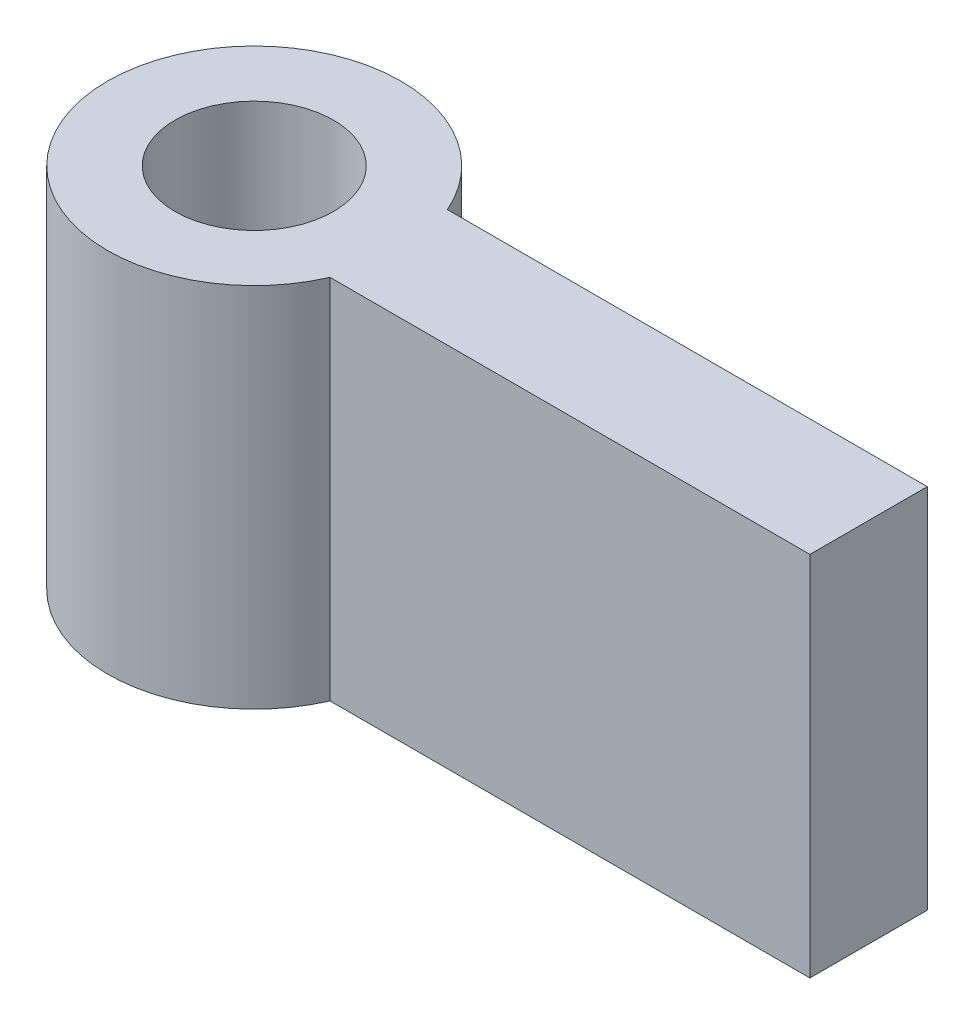
ISO-10303-21;
HEADER;
FILE_DESCRIPTION(('STEP AP214'),'2;1');
FILE_NAME('part.step','',(''),(''),'','','');
FILE_SCHEMA(('AUTOMOTIVE_DESIGN { 1 0 10303 214 1 1 1 1 }'));
ENDSEC;
DATA;
#1=APPLICATION_CONTEXT('core data for automotive mechanical design processes');
#2=APPLICATION_PROTOCOL_DEFINITION('international standard','automotive_design',2000,#1);
#3=PRODUCT_CONTEXT('',#1,'mechanical');
#4=PRODUCT('Part','Part','',(#3));
#5=PRODUCT_RELATED_PRODUCT_CATEGORY('part','',(#4));
#6=PRODUCT_DEFINITION_FORMATION('','',#4);
#7=PRODUCT_DEFINITION_CONTEXT('part definition',#1,'design');
#8=PRODUCT_DEFINITION('design','',#6,#7);
#9=PRODUCT_DEFINITION_SHAPE('','',#8);
#10=(LENGTH_UNIT() NAMED_UNIT(*) SI_UNIT(.MILLI.,.METRE.));
#11=(NAMED_UNIT(*) PLANE_ANGLE_UNIT() SI_UNIT($,.RADIAN.));
#12=(NAMED_UNIT(*) SI_UNIT($,.STERADIAN.) SOLID_ANGLE_UNIT());
#13=UNCERTAINTY_MEASURE_WITH_UNIT(LENGTH_MEASURE(1.E-05),#10,'distance_accuracy_value','');
#14=(GEOMETRIC_REPRESENTATION_CONTEXT(3) GLOBAL_UNCERTAINTY_ASSIGNED_CONTEXT((#13)) GLOBAL_UNIT_ASSIGNED_CONTEXT((#10,
#11,#12)) REPRESENTATION_CONTEXT('',''));
#15=CARTESIAN_POINT('',(0.,0.,0.));
#16=DIRECTION('',(0.,0.,1.));
#17=DIRECTION('',(1.,0.,0.));
#18=AXIS2_PLACEMENT_3D('',#15,#16,#17);
#19=CARTESIAN_POINT('',(-5.81985810583744,15.875,-2.54002984784004));
#20=DIRECTION('',(0.,-1.,0.));
#21=DIRECTION('',(0.,0.,-1.));
#22=AXIS2_PLACEMENT_3D('',#19,#20,#21);
#23=CYLINDRICAL_SURFACE('',#22,6.35);
#24=CARTESIAN_POINT('',(-5.81985810583744,0.,-2.54002984784004));
#25=DIRECTION('',(0.,1.,0.));
#26=DIRECTION('',(0.,0.,-1.));
#27=AXIS2_PLACEMENT_3D('',#24,#25,#26);
#28=CIRCLE('',#27,6.35);
#29=CARTESIAN_POINT('',(2.6053330726963E-05,0.,-5.08));
#30=VERTEX_POINT('',#29);
#31=CARTESIAN_POINT('',(0.,0.,0.));
#32=VERTEX_POINT('',#31);
#33=EDGE_CURVE('E98',#30,#32,#28,.T.);
#34=ORIENTED_EDGE('',*,*,#33,.T.);
#35=DIRECTION('',(0.,-1.,0.));
#36=VECTOR('',#35,1.);
#37=CARTESIAN_POINT('',(0.,15.875,0.));
#38=LINE('',#37,#36);
#39=CARTESIAN_POINT('',(0.,15.875,0.));
#40=VERTEX_POINT('',#39);
#41=EDGE_CURVE('E11',#40,#32,#38,.T.);
#42=ORIENTED_EDGE('',*,*,#41,.F.);
#43=CARTESIAN_POINT('',(-5.81985810583744,15.875,-2.54002984784004));
#44=DIRECTION('',(0.,1.,0.));
#45=DIRECTION('',(0.,0.,-1.));
#46=AXIS2_PLACEMENT_3D('',#43,#44,#45);
#47=CIRCLE('',#46,6.35);
#48=CARTESIAN_POINT('',(2.6053330726963E-05,15.875,-5.08));
#49=VERTEX_POINT('',#48);
#50=EDGE_CURVE('E85',#49,#40,#47,.T.);
#51=ORIENTED_EDGE('',*,*,#50,.F.);
#52=DIRECTION('',(0.,-1.,0.));
#53=VECTOR('',#52,1.);
#54=CARTESIAN_POINT('',(2.6053330726963E-05,15.875,-5.08));
#55=LINE('',#54,#53);
#56=EDGE_CURVE('E94',#49,#30,#55,.T.);
#57=ORIENTED_EDGE('',*,*,#56,.T.);
#58=EDGE_LOOP('',(#34,#42,#51,#57));
#59=FACE_BOUND('',#58,.T.);
#60=ADVANCED_FACE('F33',(#59),#23,.T.);
#61=CARTESIAN_POINT('',(0.,15.875,0.));
#62=DIRECTION('',(0.,0.,-1.));
#63=DIRECTION('',(-1.,0.,0.));
#64=AXIS2_PLACEMENT_3D('',#61,#62,#63);
#65=PLANE('',#64);
#66=DIRECTION('',(1.,0.,0.));
#67=VECTOR('',#66,1.);
#68=CARTESIAN_POINT('',(0.,0.,0.));
#69=LINE('',#68,#67);
#70=CARTESIAN_POINT('',(20.7657960533307,0.,0.));
#71=VERTEX_POINT('',#70);
#72=EDGE_CURVE('E89',#32,#71,#69,.T.);
#73=ORIENTED_EDGE('',*,*,#72,.T.);
#74=DIRECTION('',(0.,-1.,0.));
#75=VECTOR('',#74,1.);
#76=CARTESIAN_POINT('',(20.7657960533307,15.875,0.));
#77=LINE('',#76,#75);
#78=CARTESIAN_POINT('',(20.7657960533307,15.875,0.));
#79=VERTEX_POINT('',#78);
#80=EDGE_CURVE('E42',#79,#71,#77,.T.);
#81=ORIENTED_EDGE('',*,*,#80,.F.);
#82=DIRECTION('',(1.,0.,0.));
#83=VECTOR('',#82,1.);
#84=CARTESIAN_POINT('',(0.,15.875,0.));
#85=LINE('',#84,#83);
#86=EDGE_CURVE('E80',#40,#79,#85,.T.);
#87=ORIENTED_EDGE('',*,*,#86,.F.);
#88=ORIENTED_EDGE('',*,*,#41,.T.);
#89=EDGE_LOOP('',(#73,#81,#87,#88));
#90=FACE_BOUND('',#89,.T.);
#91=ADVANCED_FACE('F88',(#90),#65,.F.);
#92=CARTESIAN_POINT('',(20.7657960533307,15.875,0.));
#93=DIRECTION('',(-1.,0.,0.));
#94=DIRECTION('',(0.,0.,1.));
#95=AXIS2_PLACEMENT_3D('',#92,#93,#94);
#96=PLANE('',#95);
#97=DIRECTION('',(0.,0.,-1.));
#98=VECTOR('',#97,1.);
#99=CARTESIAN_POINT('',(20.7657960533307,0.,0.));
#100=LINE('',#99,#98);
#101=CARTESIAN_POINT('',(20.7657960533307,0.,-5.08));
#102=VERTEX_POINT('',#101);
#103=EDGE_CURVE('E67',#71,#102,#100,.T.);
#104=ORIENTED_EDGE('',*,*,#103,.T.);
#105=DIRECTION('',(0.,-1.,0.));
#106=VECTOR('',#105,1.);
#107=CARTESIAN_POINT('',(20.7657960533307,15.875,-5.08));
#108=LINE('',#107,#106);
#109=CARTESIAN_POINT('',(20.7657960533307,15.875,-5.08));
#110=VERTEX_POINT('',#109);
#111=EDGE_CURVE('E90',#110,#102,#108,.T.);
#112=ORIENTED_EDGE('',*,*,#111,.F.);
#113=DIRECTION('',(0.,0.,-1.));
#114=VECTOR('',#113,1.);
#115=CARTESIAN_POINT('',(20.7657960533307,15.875,0.));
#116=LINE('',#115,#114);
#117=EDGE_CURVE('E83',#79,#110,#116,.T.);
#118=ORIENTED_EDGE('',*,*,#117,.F.);
#119=ORIENTED_EDGE('',*,*,#80,.T.);
#120=EDGE_LOOP('',(#104,#112,#118,#119));
#121=FACE_BOUND('',#120,.T.);
#122=ADVANCED_FACE('F92',(#121),#96,.F.);
#123=CARTESIAN_POINT('',(20.7657960533307,15.875,-5.08));
#124=DIRECTION('',(0.,0.,1.));
#125=DIRECTION('',(1.,0.,0.));
#126=AXIS2_PLACEMENT_3D('',#123,#124,#125);
#127=PLANE('',#126);
#128=DIRECTION('',(-1.,0.,0.));
#129=VECTOR('',#128,1.);
#130=CARTESIAN_POINT('',(20.7657960533307,0.,-5.08));
#131=LINE('',#130,#129);
#132=EDGE_CURVE('E73',#102,#30,#131,.T.);
#133=ORIENTED_EDGE('',*,*,#132,.T.);
#134=ORIENTED_EDGE('',*,*,#56,.F.);
#135=DIRECTION('',(-1.,0.,0.));
#136=VECTOR('',#135,1.);
#137=CARTESIAN_POINT('',(20.7657960533307,15.875,-5.08));
#138=LINE('',#137,#136);
#139=EDGE_CURVE('E50',#110,#49,#138,.T.);
#140=ORIENTED_EDGE('',*,*,#139,.F.);
#141=ORIENTED_EDGE('',*,*,#111,.T.);
#142=EDGE_LOOP('',(#133,#134,#140,#141));
#143=FACE_BOUND('',#142,.T.);
#144=ADVANCED_FACE('F105',(#143),#127,.F.);
#145=CARTESIAN_POINT('',(-5.81985810583744,15.875,-2.54002984784004));
#146=DIRECTION('',(0.,-1.,0.));
#147=DIRECTION('',(0.,0.,-1.));
#148=AXIS2_PLACEMENT_3D('',#145,#146,#147);
#149=PLANE('',#148);
#150=CARTESIAN_POINT('',(-5.81985810583744,15.875,-2.54002984784004));
#151=DIRECTION('',(0.,1.,0.));
#152=DIRECTION('',(0.,0.,1.));
#153=AXIS2_PLACEMENT_3D('',#150,#151,#152);
#154=CIRCLE('',#153,3.429);
#155=CARTESIAN_POINT('',(-5.81985810583744,15.875,0.888970152159963));
#156=VERTEX_POINT('',#155);
#157=EDGE_CURVE('E111',#156,#156,#154,.T.);
#158=ORIENTED_EDGE('',*,*,#157,.F.);
#159=EDGE_LOOP('',(#158));
#160=FACE_BOUND('',#159,.T.);
#161=ORIENTED_EDGE('',*,*,#50,.T.);
#162=ORIENTED_EDGE('',*,*,#86,.T.);
#163=ORIENTED_EDGE('',*,*,#117,.T.);
#164=ORIENTED_EDGE('',*,*,#139,.T.);
#165=EDGE_LOOP('',(#161,#162,#163,#164));
#166=FACE_BOUND('',#165,.T.);
#167=ADVANCED_FACE('F81',(#160,#166),#149,.F.);
#168=CARTESIAN_POINT('',(-5.81985810583744,0.,-2.54002984784004));
#169=DIRECTION('',(0.,-1.,0.));
#170=DIRECTION('',(0.,0.,-1.));
#171=AXIS2_PLACEMENT_3D('',#168,#169,#170);
#172=PLANE('',#171);
#173=CARTESIAN_POINT('',(-5.81985810583744,0.,-2.54002984784004));
#174=DIRECTION('',(0.,-1.,0.));
#175=DIRECTION('',(0.,0.,-1.));
#176=AXIS2_PLACEMENT_3D('',#173,#174,#175);
#177=CIRCLE('',#176,3.429);
#178=CARTESIAN_POINT('',(-5.81985810583744,0.,-5.96902984784004));
#179=VERTEX_POINT('',#178);
#180=EDGE_CURVE('E36',#179,#179,#177,.T.);
#181=ORIENTED_EDGE('',*,*,#180,.F.);
#182=EDGE_LOOP('',(#181));
#183=FACE_BOUND('',#182,.T.);
#184=ORIENTED_EDGE('',*,*,#33,.F.);
#185=ORIENTED_EDGE('',*,*,#132,.F.);
#186=ORIENTED_EDGE('',*,*,#103,.F.);
#187=ORIENTED_EDGE('',*,*,#72,.F.);
#188=EDGE_LOOP('',(#184,#185,#186,#187));
#189=FACE_BOUND('',#188,.T.);
#190=ADVANCED_FACE('F108',(#183,#189),#172,.T.);
#191=CARTESIAN_POINT('',(-5.81985810583744,-9.525,-2.54002984784004));
#192=DIRECTION('',(0.,1.,0.));
#193=DIRECTION('',(0.,0.,1.));
#194=AXIS2_PLACEMENT_3D('',#191,#192,#193);
#195=CYLINDRICAL_SURFACE('',#194,3.429);
#196=ORIENTED_EDGE('',*,*,#180,.T.);
#197=EDGE_LOOP('',(#196));
#198=FACE_BOUND('',#197,.T.);
#199=ORIENTED_EDGE('',*,*,#157,.T.);
#200=EDGE_LOOP('',(#199));
#201=FACE_BOUND('',#200,.T.);
#202=ADVANCED_FACE('F118',(#198,#201),#195,.F.);
#203=CLOSED_SHELL('',(#60,#91,#122,#144,#167,#190,#202));
#204=MANIFOLD_SOLID_BREP('B2',#203);
#205=ADVANCED_BREP_SHAPE_REPRESENTATION('',(#18,#204),#14);
#206=SHAPE_DEFINITION_REPRESENTATION(#9,#205);
ENDSEC;
END-ISO-10303-21;
